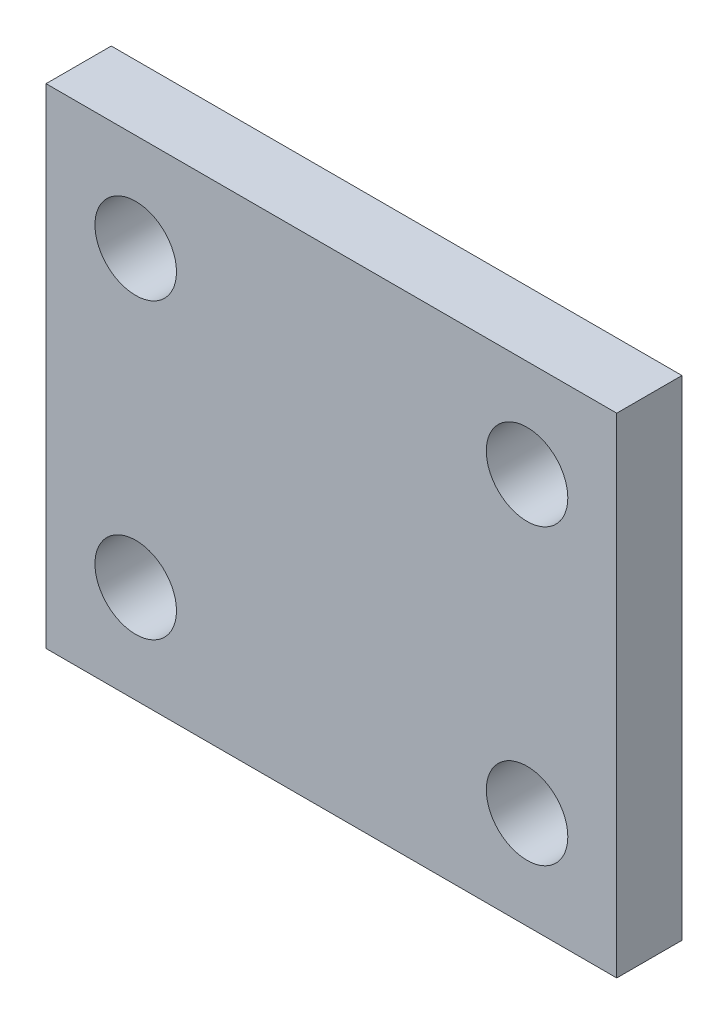
ISO-10303-21;
HEADER;
FILE_DESCRIPTION(('STEP AP214'),'2;1');
FILE_NAME('part.step','',(''),(''),'','','');
FILE_SCHEMA(('AUTOMOTIVE_DESIGN { 1 0 10303 214 1 1 1 1 }'));
ENDSEC;
DATA;
#1=APPLICATION_CONTEXT('core data for automotive mechanical design processes');
#2=APPLICATION_PROTOCOL_DEFINITION('international standard','automotive_design',2000,#1);
#3=PRODUCT_CONTEXT('',#1,'mechanical');
#4=PRODUCT('Part','Part','',(#3));
#5=PRODUCT_RELATED_PRODUCT_CATEGORY('part','',(#4));
#6=PRODUCT_DEFINITION_FORMATION('','',#4);
#7=PRODUCT_DEFINITION_CONTEXT('part definition',#1,'design');
#8=PRODUCT_DEFINITION('design','',#6,#7);
#9=PRODUCT_DEFINITION_SHAPE('','',#8);
#10=(LENGTH_UNIT() NAMED_UNIT(*) SI_UNIT(.MILLI.,.METRE.));
#11=(NAMED_UNIT(*) PLANE_ANGLE_UNIT() SI_UNIT($,.RADIAN.));
#12=(NAMED_UNIT(*) SI_UNIT($,.STERADIAN.) SOLID_ANGLE_UNIT());
#13=UNCERTAINTY_MEASURE_WITH_UNIT(LENGTH_MEASURE(1.E-05),#10,'distance_accuracy_value','');
#14=(GEOMETRIC_REPRESENTATION_CONTEXT(3) GLOBAL_UNCERTAINTY_ASSIGNED_CONTEXT((#13)) GLOBAL_UNIT_ASSIGNED_CONTEXT((#10,
#11,#12)) REPRESENTATION_CONTEXT('',''));
#15=CARTESIAN_POINT('',(0.,0.,0.));
#16=DIRECTION('',(0.,0.,1.));
#17=DIRECTION('',(1.,0.,0.));
#18=AXIS2_PLACEMENT_3D('',#15,#16,#17);
#19=CARTESIAN_POINT('',(0.,0.,4.));
#20=DIRECTION('',(0.,0.,-1.));
#21=DIRECTION('',(-1.,0.,0.));
#22=AXIS2_PLACEMENT_3D('',#19,#20,#21);
#23=PLANE('',#22);
#24=DIRECTION('',(0.,-1.,0.));
#25=VECTOR('',#24,1.);
#26=CARTESIAN_POINT('',(0.,0.,4.));
#27=LINE('',#26,#25);
#28=CARTESIAN_POINT('',(0.,30.,4.));
#29=VERTEX_POINT('',#28);
#30=CARTESIAN_POINT('',(0.,0.,4.));
#31=VERTEX_POINT('',#30);
#32=EDGE_CURVE('E94',#29,#31,#27,.T.);
#33=ORIENTED_EDGE('',*,*,#32,.T.);
#34=DIRECTION('',(1.,0.,0.));
#35=VECTOR('',#34,1.);
#36=CARTESIAN_POINT('',(0.,0.,4.));
#37=LINE('',#36,#35);
#38=CARTESIAN_POINT('',(35.,0.,4.));
#39=VERTEX_POINT('',#38);
#40=EDGE_CURVE('E89',#31,#39,#37,.T.);
#41=ORIENTED_EDGE('',*,*,#40,.T.);
#42=DIRECTION('',(0.,1.,0.));
#43=VECTOR('',#42,1.);
#44=CARTESIAN_POINT('',(35.,0.,4.));
#45=LINE('',#44,#43);
#46=CARTESIAN_POINT('',(35.,30.,4.));
#47=VERTEX_POINT('',#46);
#48=EDGE_CURVE('E92',#39,#47,#45,.T.);
#49=ORIENTED_EDGE('',*,*,#48,.T.);
#50=DIRECTION('',(-1.,0.,0.));
#51=VECTOR('',#50,1.);
#52=CARTESIAN_POINT('',(0.,30.,4.));
#53=LINE('',#52,#51);
#54=EDGE_CURVE('E59',#47,#29,#53,.T.);
#55=ORIENTED_EDGE('',*,*,#54,.T.);
#56=EDGE_LOOP('',(#33,#41,#49,#55));
#57=FACE_BOUND('',#56,.T.);
#58=CARTESIAN_POINT('',(5.5,24.,4.));
#59=DIRECTION('',(0.,0.,1.));
#60=DIRECTION('',(1.,0.,0.));
#61=AXIS2_PLACEMENT_3D('',#58,#59,#60);
#62=CIRCLE('',#61,2.5);
#63=CARTESIAN_POINT('',(8.,24.,4.));
#64=VERTEX_POINT('',#63);
#65=EDGE_CURVE('E114',#64,#64,#62,.T.);
#66=ORIENTED_EDGE('',*,*,#65,.F.);
#67=EDGE_LOOP('',(#66));
#68=FACE_BOUND('',#67,.T.);
#69=CARTESIAN_POINT('',(29.5,24.,4.));
#70=DIRECTION('',(0.,0.,1.));
#71=DIRECTION('',(1.,0.,0.));
#72=AXIS2_PLACEMENT_3D('',#69,#70,#71);
#73=CIRCLE('',#72,2.5);
#74=CARTESIAN_POINT('',(32.,24.,4.));
#75=VERTEX_POINT('',#74);
#76=EDGE_CURVE('E136',#75,#75,#73,.T.);
#77=ORIENTED_EDGE('',*,*,#76,.F.);
#78=EDGE_LOOP('',(#77));
#79=FACE_BOUND('',#78,.T.);
#80=CARTESIAN_POINT('',(5.5,6.,4.));
#81=DIRECTION('',(0.,0.,1.));
#82=DIRECTION('',(1.,0.,0.));
#83=AXIS2_PLACEMENT_3D('',#80,#81,#82);
#84=CIRCLE('',#83,2.5);
#85=CARTESIAN_POINT('',(8.,6.,4.));
#86=VERTEX_POINT('',#85);
#87=EDGE_CURVE('E144',#86,#86,#84,.T.);
#88=ORIENTED_EDGE('',*,*,#87,.F.);
#89=EDGE_LOOP('',(#88));
#90=FACE_BOUND('',#89,.T.);
#91=CARTESIAN_POINT('',(29.5,6.,4.));
#92=DIRECTION('',(0.,0.,1.));
#93=DIRECTION('',(1.,0.,0.));
#94=AXIS2_PLACEMENT_3D('',#91,#92,#93);
#95=CIRCLE('',#94,2.5);
#96=CARTESIAN_POINT('',(32.,6.,4.));
#97=VERTEX_POINT('',#96);
#98=EDGE_CURVE('E152',#97,#97,#95,.T.);
#99=ORIENTED_EDGE('',*,*,#98,.F.);
#100=EDGE_LOOP('',(#99));
#101=FACE_BOUND('',#100,.T.);
#102=ADVANCED_FACE('F41',(#57,#68,#79,#90,#101),#23,.F.);
#103=CARTESIAN_POINT('',(0.,0.,0.));
#104=DIRECTION('',(0.,0.,-1.));
#105=DIRECTION('',(-1.,0.,0.));
#106=AXIS2_PLACEMENT_3D('',#103,#104,#105);
#107=PLANE('',#106);
#108=CARTESIAN_POINT('',(5.5,6.,0.));
#109=DIRECTION('',(0.,0.,1.));
#110=DIRECTION('',(1.,0.,0.));
#111=AXIS2_PLACEMENT_3D('',#108,#109,#110);
#112=CIRCLE('',#111,2.5);
#113=CARTESIAN_POINT('',(8.,6.,0.));
#114=VERTEX_POINT('',#113);
#115=EDGE_CURVE('E148',#114,#114,#112,.T.);
#116=ORIENTED_EDGE('',*,*,#115,.T.);
#117=EDGE_LOOP('',(#116));
#118=FACE_BOUND('',#117,.T.);
#119=CARTESIAN_POINT('',(5.5,24.,0.));
#120=DIRECTION('',(0.,0.,1.));
#121=DIRECTION('',(1.,0.,0.));
#122=AXIS2_PLACEMENT_3D('',#119,#120,#121);
#123=CIRCLE('',#122,2.5);
#124=CARTESIAN_POINT('',(8.,24.,0.));
#125=VERTEX_POINT('',#124);
#126=EDGE_CURVE('E132',#125,#125,#123,.T.);
#127=ORIENTED_EDGE('',*,*,#126,.T.);
#128=EDGE_LOOP('',(#127));
#129=FACE_BOUND('',#128,.T.);
#130=DIRECTION('',(0.,-1.,0.));
#131=VECTOR('',#130,1.);
#132=CARTESIAN_POINT('',(0.,0.,0.));
#133=LINE('',#132,#131);
#134=CARTESIAN_POINT('',(0.,30.,0.));
#135=VERTEX_POINT('',#134);
#136=CARTESIAN_POINT('',(0.,0.,0.));
#137=VERTEX_POINT('',#136);
#138=EDGE_CURVE('E110',#135,#137,#133,.T.);
#139=ORIENTED_EDGE('',*,*,#138,.F.);
#140=DIRECTION('',(-1.,0.,0.));
#141=VECTOR('',#140,1.);
#142=CARTESIAN_POINT('',(0.,30.,0.));
#143=LINE('',#142,#141);
#144=CARTESIAN_POINT('',(35.,30.,0.));
#145=VERTEX_POINT('',#144);
#146=EDGE_CURVE('E82',#145,#135,#143,.T.);
#147=ORIENTED_EDGE('',*,*,#146,.F.);
#148=DIRECTION('',(0.,1.,0.));
#149=VECTOR('',#148,1.);
#150=CARTESIAN_POINT('',(35.,0.,0.));
#151=LINE('',#150,#149);
#152=CARTESIAN_POINT('',(35.,0.,0.));
#153=VERTEX_POINT('',#152);
#154=EDGE_CURVE('E76',#153,#145,#151,.T.);
#155=ORIENTED_EDGE('',*,*,#154,.F.);
#156=DIRECTION('',(1.,0.,0.));
#157=VECTOR('',#156,1.);
#158=CARTESIAN_POINT('',(0.,0.,0.));
#159=LINE('',#158,#157);
#160=EDGE_CURVE('E99',#137,#153,#159,.T.);
#161=ORIENTED_EDGE('',*,*,#160,.F.);
#162=EDGE_LOOP('',(#139,#147,#155,#161));
#163=FACE_BOUND('',#162,.T.);
#164=CARTESIAN_POINT('',(29.5,24.,0.));
#165=DIRECTION('',(0.,0.,1.));
#166=DIRECTION('',(1.,0.,0.));
#167=AXIS2_PLACEMENT_3D('',#164,#165,#166);
#168=CIRCLE('',#167,2.5);
#169=CARTESIAN_POINT('',(32.,24.,0.));
#170=VERTEX_POINT('',#169);
#171=EDGE_CURVE('E140',#170,#170,#168,.T.);
#172=ORIENTED_EDGE('',*,*,#171,.T.);
#173=EDGE_LOOP('',(#172));
#174=FACE_BOUND('',#173,.T.);
#175=CARTESIAN_POINT('',(29.5,6.,0.));
#176=DIRECTION('',(0.,0.,1.));
#177=DIRECTION('',(1.,0.,0.));
#178=AXIS2_PLACEMENT_3D('',#175,#176,#177);
#179=CIRCLE('',#178,2.5);
#180=CARTESIAN_POINT('',(32.,6.,0.));
#181=VERTEX_POINT('',#180);
#182=EDGE_CURVE('E156',#181,#181,#179,.T.);
#183=ORIENTED_EDGE('',*,*,#182,.T.);
#184=EDGE_LOOP('',(#183));
#185=FACE_BOUND('',#184,.T.);
#186=ADVANCED_FACE('F127',(#118,#129,#163,#174,#185),#107,.T.);
#187=CARTESIAN_POINT('',(0.,0.,4.));
#188=DIRECTION('',(1.,0.,0.));
#189=DIRECTION('',(0.,0.,-1.));
#190=AXIS2_PLACEMENT_3D('',#187,#188,#189);
#191=PLANE('',#190);
#192=ORIENTED_EDGE('',*,*,#138,.T.);
#193=DIRECTION('',(0.,0.,-1.));
#194=VECTOR('',#193,1.);
#195=CARTESIAN_POINT('',(0.,0.,4.));
#196=LINE('',#195,#194);
#197=EDGE_CURVE('E11',#31,#137,#196,.T.);
#198=ORIENTED_EDGE('',*,*,#197,.F.);
#199=ORIENTED_EDGE('',*,*,#32,.F.);
#200=DIRECTION('',(0.,0.,-1.));
#201=VECTOR('',#200,1.);
#202=CARTESIAN_POINT('',(0.,30.,4.));
#203=LINE('',#202,#201);
#204=EDGE_CURVE('E106',#29,#135,#203,.T.);
#205=ORIENTED_EDGE('',*,*,#204,.T.);
#206=EDGE_LOOP('',(#192,#198,#199,#205));
#207=FACE_BOUND('',#206,.T.);
#208=ADVANCED_FACE('F43',(#207),#191,.F.);
#209=CARTESIAN_POINT('',(0.,0.,4.));
#210=DIRECTION('',(0.,1.,0.));
#211=DIRECTION('',(0.,0.,1.));
#212=AXIS2_PLACEMENT_3D('',#209,#210,#211);
#213=PLANE('',#212);
#214=ORIENTED_EDGE('',*,*,#160,.T.);
#215=DIRECTION('',(0.,0.,-1.));
#216=VECTOR('',#215,1.);
#217=CARTESIAN_POINT('',(35.,0.,4.));
#218=LINE('',#217,#216);
#219=EDGE_CURVE('E51',#39,#153,#218,.T.);
#220=ORIENTED_EDGE('',*,*,#219,.F.);
#221=ORIENTED_EDGE('',*,*,#40,.F.);
#222=ORIENTED_EDGE('',*,*,#197,.T.);
#223=EDGE_LOOP('',(#214,#220,#221,#222));
#224=FACE_BOUND('',#223,.T.);
#225=ADVANCED_FACE('F98',(#224),#213,.F.);
#226=CARTESIAN_POINT('',(35.,0.,4.));
#227=DIRECTION('',(-1.,0.,0.));
#228=DIRECTION('',(0.,0.,1.));
#229=AXIS2_PLACEMENT_3D('',#226,#227,#228);
#230=PLANE('',#229);
#231=ORIENTED_EDGE('',*,*,#154,.T.);
#232=DIRECTION('',(0.,0.,-1.));
#233=VECTOR('',#232,1.);
#234=CARTESIAN_POINT('',(35.,30.,4.));
#235=LINE('',#234,#233);
#236=EDGE_CURVE('E101',#47,#145,#235,.T.);
#237=ORIENTED_EDGE('',*,*,#236,.F.);
#238=ORIENTED_EDGE('',*,*,#48,.F.);
#239=ORIENTED_EDGE('',*,*,#219,.T.);
#240=EDGE_LOOP('',(#231,#237,#238,#239));
#241=FACE_BOUND('',#240,.T.);
#242=ADVANCED_FACE('F102',(#241),#230,.F.);
#243=CARTESIAN_POINT('',(0.,30.,4.));
#244=DIRECTION('',(0.,-1.,0.));
#245=DIRECTION('',(0.,0.,-1.));
#246=AXIS2_PLACEMENT_3D('',#243,#244,#245);
#247=PLANE('',#246);
#248=ORIENTED_EDGE('',*,*,#146,.T.);
#249=ORIENTED_EDGE('',*,*,#204,.F.);
#250=ORIENTED_EDGE('',*,*,#54,.F.);
#251=ORIENTED_EDGE('',*,*,#236,.T.);
#252=EDGE_LOOP('',(#248,#249,#250,#251));
#253=FACE_BOUND('',#252,.T.);
#254=ADVANCED_FACE('F124',(#253),#247,.F.);
#255=CARTESIAN_POINT('',(5.5,24.,4.));
#256=DIRECTION('',(0.,0.,-1.));
#257=DIRECTION('',(-1.,0.,0.));
#258=AXIS2_PLACEMENT_3D('',#255,#256,#257);
#259=CYLINDRICAL_SURFACE('',#258,2.5);
#260=ORIENTED_EDGE('',*,*,#65,.T.);
#261=EDGE_LOOP('',(#260));
#262=FACE_BOUND('',#261,.T.);
#263=ORIENTED_EDGE('',*,*,#126,.F.);
#264=EDGE_LOOP('',(#263));
#265=FACE_BOUND('',#264,.T.);
#266=ADVANCED_FACE('F175',(#262,#265),#259,.F.);
#267=CARTESIAN_POINT('',(29.5,24.,4.));
#268=DIRECTION('',(0.,0.,-1.));
#269=DIRECTION('',(-1.,0.,0.));
#270=AXIS2_PLACEMENT_3D('',#267,#268,#269);
#271=CYLINDRICAL_SURFACE('',#270,2.5);
#272=ORIENTED_EDGE('',*,*,#76,.T.);
#273=EDGE_LOOP('',(#272));
#274=FACE_BOUND('',#273,.T.);
#275=ORIENTED_EDGE('',*,*,#171,.F.);
#276=EDGE_LOOP('',(#275));
#277=FACE_BOUND('',#276,.T.);
#278=ADVANCED_FACE('F221',(#274,#277),#271,.F.);
#279=CARTESIAN_POINT('',(5.5,6.,4.));
#280=DIRECTION('',(0.,0.,-1.));
#281=DIRECTION('',(-1.,0.,0.));
#282=AXIS2_PLACEMENT_3D('',#279,#280,#281);
#283=CYLINDRICAL_SURFACE('',#282,2.5);
#284=ORIENTED_EDGE('',*,*,#87,.T.);
#285=EDGE_LOOP('',(#284));
#286=FACE_BOUND('',#285,.T.);
#287=ORIENTED_EDGE('',*,*,#115,.F.);
#288=EDGE_LOOP('',(#287));
#289=FACE_BOUND('',#288,.T.);
#290=ADVANCED_FACE('F229',(#286,#289),#283,.F.);
#291=CARTESIAN_POINT('',(29.5,6.,4.));
#292=DIRECTION('',(0.,0.,-1.));
#293=DIRECTION('',(-1.,0.,0.));
#294=AXIS2_PLACEMENT_3D('',#291,#292,#293);
#295=CYLINDRICAL_SURFACE('',#294,2.5);
#296=ORIENTED_EDGE('',*,*,#98,.T.);
#297=EDGE_LOOP('',(#296));
#298=FACE_BOUND('',#297,.T.);
#299=ORIENTED_EDGE('',*,*,#182,.F.);
#300=EDGE_LOOP('',(#299));
#301=FACE_BOUND('',#300,.T.);
#302=ADVANCED_FACE('F164',(#298,#301),#295,.F.);
#303=CLOSED_SHELL('',(#102,#186,#208,#225,#242,#254,#266,#278,#290,#302));
#304=MANIFOLD_SOLID_BREP('B2',#303);
#305=ADVANCED_BREP_SHAPE_REPRESENTATION('',(#18,#304),#14);
#306=SHAPE_DEFINITION_REPRESENTATION(#9,#305);
ENDSEC;
END-ISO-10303-21;
